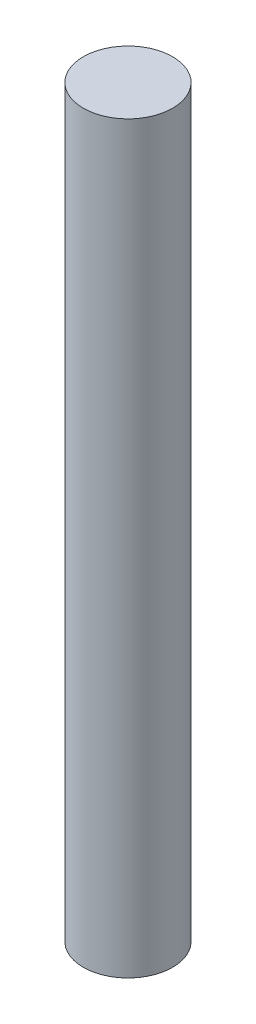
ISO-10303-21;
HEADER;
FILE_DESCRIPTION(('STEP AP214'),'2;1');
FILE_NAME('part.step','',(''),(''),'','','');
FILE_SCHEMA(('AUTOMOTIVE_DESIGN { 1 0 10303 214 1 1 1 1 }'));
ENDSEC;
DATA;
#1=APPLICATION_CONTEXT('core data for automotive mechanical design processes');
#2=APPLICATION_PROTOCOL_DEFINITION('international standard','automotive_design',2000,#1);
#3=PRODUCT_CONTEXT('',#1,'mechanical');
#4=PRODUCT('Part','Part','',(#3));
#5=PRODUCT_RELATED_PRODUCT_CATEGORY('part','',(#4));
#6=PRODUCT_DEFINITION_FORMATION('','',#4);
#7=PRODUCT_DEFINITION_CONTEXT('part definition',#1,'design');
#8=PRODUCT_DEFINITION('design','',#6,#7);
#9=PRODUCT_DEFINITION_SHAPE('','',#8);
#10=(LENGTH_UNIT() NAMED_UNIT(*) SI_UNIT(.MILLI.,.METRE.));
#11=(NAMED_UNIT(*) PLANE_ANGLE_UNIT() SI_UNIT($,.RADIAN.));
#12=(NAMED_UNIT(*) SI_UNIT($,.STERADIAN.) SOLID_ANGLE_UNIT());
#13=UNCERTAINTY_MEASURE_WITH_UNIT(LENGTH_MEASURE(1.E-05),#10,'distance_accuracy_value','');
#14=(GEOMETRIC_REPRESENTATION_CONTEXT(3) GLOBAL_UNCERTAINTY_ASSIGNED_CONTEXT((#13)) GLOBAL_UNIT_ASSIGNED_CONTEXT((#10,
#11,#12)) REPRESENTATION_CONTEXT('',''));
#15=CARTESIAN_POINT('',(0.,0.,0.));
#16=DIRECTION('',(0.,0.,1.));
#17=DIRECTION('',(1.,0.,0.));
#18=AXIS2_PLACEMENT_3D('',#15,#16,#17);
#19=CARTESIAN_POINT('',(0.,30.,0.));
#20=DIRECTION('',(0.,-1.,0.));
#21=DIRECTION('',(0.,0.,-1.));
#22=AXIS2_PLACEMENT_3D('',#19,#20,#21);
#23=CYLINDRICAL_SURFACE('',#22,1.8);
#24=CARTESIAN_POINT('',(0.,30.,0.));
#25=DIRECTION('',(0.,1.,0.));
#26=DIRECTION('',(0.,0.,1.));
#27=AXIS2_PLACEMENT_3D('',#24,#25,#26);
#28=CIRCLE('',#27,1.8);
#29=CARTESIAN_POINT('',(0.,30.,1.8));
#30=VERTEX_POINT('',#29);
#31=EDGE_CURVE('E10',#30,#30,#28,.T.);
#32=ORIENTED_EDGE('',*,*,#31,.F.);
#33=EDGE_LOOP('',(#32));
#34=FACE_BOUND('',#33,.T.);
#35=CARTESIAN_POINT('',(0.,0.,0.));
#36=DIRECTION('',(0.,1.,0.));
#37=DIRECTION('',(0.,0.,1.));
#38=AXIS2_PLACEMENT_3D('',#35,#36,#37);
#39=CIRCLE('',#38,1.8);
#40=CARTESIAN_POINT('',(0.,0.,1.8));
#41=VERTEX_POINT('',#40);
#42=EDGE_CURVE('E44',#41,#41,#39,.T.);
#43=ORIENTED_EDGE('',*,*,#42,.T.);
#44=EDGE_LOOP('',(#43));
#45=FACE_BOUND('',#44,.T.);
#46=ADVANCED_FACE('F41',(#34,#45),#23,.T.);
#47=CARTESIAN_POINT('',(0.,30.,0.));
#48=DIRECTION('',(0.,1.,0.));
#49=DIRECTION('',(0.,0.,1.));
#50=AXIS2_PLACEMENT_3D('',#47,#48,#49);
#51=PLANE('',#50);
#52=ORIENTED_EDGE('',*,*,#31,.T.);
#53=EDGE_LOOP('',(#52));
#54=FACE_BOUND('',#53,.T.);
#55=ADVANCED_FACE('F58',(#54),#51,.T.);
#56=CARTESIAN_POINT('',(0.,0.,0.));
#57=DIRECTION('',(0.,1.,0.));
#58=DIRECTION('',(0.,0.,1.));
#59=AXIS2_PLACEMENT_3D('',#56,#57,#58);
#60=PLANE('',#59);
#61=ORIENTED_EDGE('',*,*,#42,.F.);
#62=EDGE_LOOP('',(#61));
#63=FACE_BOUND('',#62,.T.);
#64=ADVANCED_FACE('F56',(#63),#60,.F.);
#65=CLOSED_SHELL('',(#46,#55,#64));
#66=MANIFOLD_SOLID_BREP('B2',#65);
#67=ADVANCED_BREP_SHAPE_REPRESENTATION('',(#18,#66),#14);
#68=SHAPE_DEFINITION_REPRESENTATION(#9,#67);
ENDSEC;
END-ISO-10303-21;
